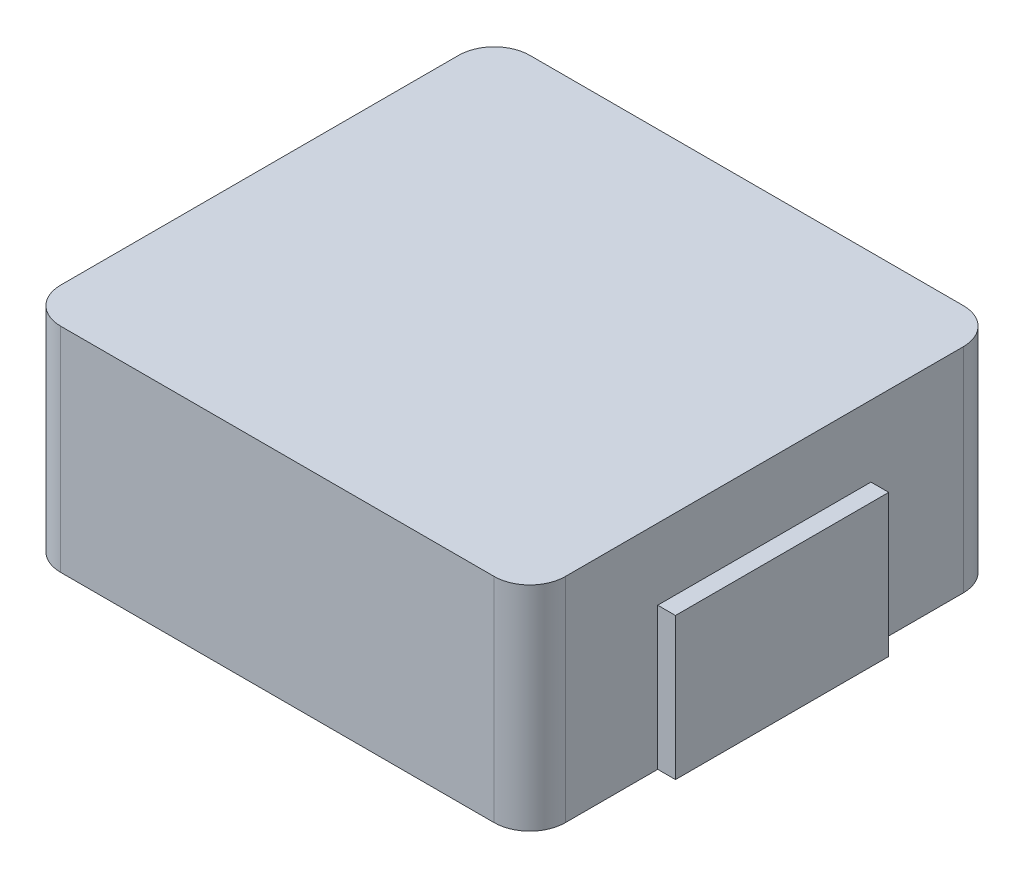
ISO-10303-21;
HEADER;
FILE_DESCRIPTION(('STEP AP214'),'2;1');
FILE_NAME('part.step','',(''),(''),'','','');
FILE_SCHEMA(('AUTOMOTIVE_DESIGN { 1 0 10303 214 1 1 1 1 }'));
ENDSEC;
DATA;
#1=APPLICATION_CONTEXT('core data for automotive mechanical design processes');
#2=APPLICATION_PROTOCOL_DEFINITION('international standard','automotive_design',2000,#1);
#3=PRODUCT_CONTEXT('',#1,'mechanical');
#4=PRODUCT('Part','Part','',(#3));
#5=PRODUCT_RELATED_PRODUCT_CATEGORY('part','',(#4));
#6=PRODUCT_DEFINITION_FORMATION('','',#4);
#7=PRODUCT_DEFINITION_CONTEXT('part definition',#1,'design');
#8=PRODUCT_DEFINITION('design','',#6,#7);
#9=PRODUCT_DEFINITION_SHAPE('','',#8);
#10=(LENGTH_UNIT() NAMED_UNIT(*) SI_UNIT(.MILLI.,.METRE.));
#11=(NAMED_UNIT(*) PLANE_ANGLE_UNIT() SI_UNIT($,.RADIAN.));
#12=(NAMED_UNIT(*) SI_UNIT($,.STERADIAN.) SOLID_ANGLE_UNIT());
#13=UNCERTAINTY_MEASURE_WITH_UNIT(LENGTH_MEASURE(1.E-05),#10,'distance_accuracy_value','');
#14=(GEOMETRIC_REPRESENTATION_CONTEXT(3) GLOBAL_UNCERTAINTY_ASSIGNED_CONTEXT((#13)) GLOBAL_UNIT_ASSIGNED_CONTEXT((#10,
#11,#12)) REPRESENTATION_CONTEXT('',''));
#15=CARTESIAN_POINT('',(0.,0.,0.));
#16=DIRECTION('',(0.,0.,1.));
#17=DIRECTION('',(1.,0.,0.));
#18=AXIS2_PLACEMENT_3D('',#15,#16,#17);
#19=CARTESIAN_POINT('',(3.55,3.,3.3));
#20=DIRECTION('',(-1.,0.,0.));
#21=DIRECTION('',(0.,0.,1.));
#22=AXIS2_PLACEMENT_3D('',#19,#20,#21);
#23=PLANE('',#22);
#24=DIRECTION('',(0.,0.,1.));
#25=VECTOR('',#24,1.);
#26=CARTESIAN_POINT('',(3.55,2.,3.3));
#27=LINE('',#26,#25);
#28=CARTESIAN_POINT('',(3.55,2.,-1.5));
#29=VERTEX_POINT('',#28);
#30=CARTESIAN_POINT('',(3.55,2.,1.5));
#31=VERTEX_POINT('',#30);
#32=EDGE_CURVE('E48',#29,#31,#27,.T.);
#33=ORIENTED_EDGE('',*,*,#32,.F.);
#34=DIRECTION('',(0.,-1.,0.));
#35=VECTOR('',#34,1.);
#36=CARTESIAN_POINT('',(3.55,3.,-1.5));
#37=LINE('',#36,#35);
#38=CARTESIAN_POINT('',(3.55,0.,-1.5));
#39=VERTEX_POINT('',#38);
#40=EDGE_CURVE('E226',#29,#39,#37,.T.);
#41=ORIENTED_EDGE('',*,*,#40,.T.);
#42=DIRECTION('',(0.,0.,-1.));
#43=VECTOR('',#42,1.);
#44=CARTESIAN_POINT('',(3.55,0.,3.3));
#45=LINE('',#44,#43);
#46=CARTESIAN_POINT('',(3.55,0.,-2.8));
#47=VERTEX_POINT('',#46);
#48=EDGE_CURVE('E230',#39,#47,#45,.T.);
#49=ORIENTED_EDGE('',*,*,#48,.T.);
#50=DIRECTION('',(0.,-1.,0.));
#51=VECTOR('',#50,1.);
#52=CARTESIAN_POINT('',(3.55,3.,-2.8));
#53=LINE('',#52,#51);
#54=CARTESIAN_POINT('',(3.55,3.,-2.8));
#55=VERTEX_POINT('',#54);
#56=EDGE_CURVE('E306',#47,#55,#53,.F.);
#57=ORIENTED_EDGE('',*,*,#56,.T.);
#58=DIRECTION('',(0.,0.,-1.));
#59=VECTOR('',#58,1.);
#60=CARTESIAN_POINT('',(3.55,3.,3.3));
#61=LINE('',#60,#59);
#62=CARTESIAN_POINT('',(3.55,3.,2.8));
#63=VERTEX_POINT('',#62);
#64=EDGE_CURVE('E231',#63,#55,#61,.T.);
#65=ORIENTED_EDGE('',*,*,#64,.F.);
#66=DIRECTION('',(0.,-1.,0.));
#67=VECTOR('',#66,1.);
#68=CARTESIAN_POINT('',(3.55,3.,2.8));
#69=LINE('',#68,#67);
#70=CARTESIAN_POINT('',(3.55,0.,2.8));
#71=VERTEX_POINT('',#70);
#72=EDGE_CURVE('E302',#63,#71,#69,.T.);
#73=ORIENTED_EDGE('',*,*,#72,.T.);
#74=CARTESIAN_POINT('',(3.55,0.,1.5));
#75=VERTEX_POINT('',#74);
#76=EDGE_CURVE('E249',#71,#75,#45,.T.);
#77=ORIENTED_EDGE('',*,*,#76,.T.);
#78=DIRECTION('',(0.,1.,0.));
#79=VECTOR('',#78,1.);
#80=CARTESIAN_POINT('',(3.55,3.,1.5));
#81=LINE('',#80,#79);
#82=EDGE_CURVE('E221',#75,#31,#81,.T.);
#83=ORIENTED_EDGE('',*,*,#82,.T.);
#84=EDGE_LOOP('',(#33,#41,#49,#57,#65,#73,#77,#83));
#85=FACE_BOUND('',#84,.T.);
#86=ADVANCED_FACE('F39',(#85),#23,.F.);
#87=CARTESIAN_POINT('',(-3.55,3.,-3.3));
#88=DIRECTION('',(0.,0.,1.));
#89=DIRECTION('',(1.,0.,0.));
#90=AXIS2_PLACEMENT_3D('',#87,#88,#89);
#91=PLANE('',#90);
#92=DIRECTION('',(-1.,0.,0.));
#93=VECTOR('',#92,1.);
#94=CARTESIAN_POINT('',(-3.55,0.,-3.3));
#95=LINE('',#94,#93);
#96=CARTESIAN_POINT('',(3.05,0.,-3.3));
#97=VERTEX_POINT('',#96);
#98=CARTESIAN_POINT('',(-3.05,0.,-3.3));
#99=VERTEX_POINT('',#98);
#100=EDGE_CURVE('E252',#97,#99,#95,.T.);
#101=ORIENTED_EDGE('',*,*,#100,.T.);
#102=DIRECTION('',(0.,-1.,0.));
#103=VECTOR('',#102,1.);
#104=CARTESIAN_POINT('',(-3.05,3.,-3.3));
#105=LINE('',#104,#103);
#106=CARTESIAN_POINT('',(-3.05,3.,-3.3));
#107=VERTEX_POINT('',#106);
#108=EDGE_CURVE('E287',#99,#107,#105,.F.);
#109=ORIENTED_EDGE('',*,*,#108,.T.);
#110=DIRECTION('',(-1.,0.,0.));
#111=VECTOR('',#110,1.);
#112=CARTESIAN_POINT('',(-3.55,3.,-3.3));
#113=LINE('',#112,#111);
#114=CARTESIAN_POINT('',(3.05,3.,-3.3));
#115=VERTEX_POINT('',#114);
#116=EDGE_CURVE('E235',#115,#107,#113,.T.);
#117=ORIENTED_EDGE('',*,*,#116,.F.);
#118=DIRECTION('',(0.,-1.,0.));
#119=VECTOR('',#118,1.);
#120=CARTESIAN_POINT('',(3.05,3.,-3.3));
#121=LINE('',#120,#119);
#122=EDGE_CURVE('E283',#115,#97,#121,.T.);
#123=ORIENTED_EDGE('',*,*,#122,.T.);
#124=EDGE_LOOP('',(#101,#109,#117,#123));
#125=FACE_BOUND('',#124,.T.);
#126=ADVANCED_FACE('F350',(#125),#91,.F.);
#127=CARTESIAN_POINT('',(-3.55,3.,3.3));
#128=DIRECTION('',(1.,0.,0.));
#129=DIRECTION('',(0.,0.,-1.));
#130=AXIS2_PLACEMENT_3D('',#127,#128,#129);
#131=PLANE('',#130);
#132=DIRECTION('',(0.,0.,-1.));
#133=VECTOR('',#132,1.);
#134=CARTESIAN_POINT('',(-3.55,2.,3.3));
#135=LINE('',#134,#133);
#136=CARTESIAN_POINT('',(-3.55,2.,1.5));
#137=VERTEX_POINT('',#136);
#138=CARTESIAN_POINT('',(-3.55,2.,-1.5));
#139=VERTEX_POINT('',#138);
#140=EDGE_CURVE('E11',#137,#139,#135,.T.);
#141=ORIENTED_EDGE('',*,*,#140,.F.);
#142=DIRECTION('',(0.,-1.,0.));
#143=VECTOR('',#142,1.);
#144=CARTESIAN_POINT('',(-3.55,3.,1.5));
#145=LINE('',#144,#143);
#146=CARTESIAN_POINT('',(-3.55,0.,1.5));
#147=VERTEX_POINT('',#146);
#148=EDGE_CURVE('E156',#137,#147,#145,.T.);
#149=ORIENTED_EDGE('',*,*,#148,.T.);
#150=DIRECTION('',(0.,0.,1.));
#151=VECTOR('',#150,1.);
#152=CARTESIAN_POINT('',(-3.55,0.,3.3));
#153=LINE('',#152,#151);
#154=CARTESIAN_POINT('',(-3.55,0.,2.8));
#155=VERTEX_POINT('',#154);
#156=EDGE_CURVE('E256',#147,#155,#153,.T.);
#157=ORIENTED_EDGE('',*,*,#156,.T.);
#158=DIRECTION('',(0.,-1.,0.));
#159=VECTOR('',#158,1.);
#160=CARTESIAN_POINT('',(-3.55,3.,2.8));
#161=LINE('',#160,#159);
#162=CARTESIAN_POINT('',(-3.55,3.,2.8));
#163=VERTEX_POINT('',#162);
#164=EDGE_CURVE('E248',#155,#163,#161,.F.);
#165=ORIENTED_EDGE('',*,*,#164,.T.);
#166=DIRECTION('',(0.,0.,1.));
#167=VECTOR('',#166,1.);
#168=CARTESIAN_POINT('',(-3.55,3.,3.3));
#169=LINE('',#168,#167);
#170=CARTESIAN_POINT('',(-3.55,3.,-2.8));
#171=VERTEX_POINT('',#170);
#172=EDGE_CURVE('E240',#171,#163,#169,.T.);
#173=ORIENTED_EDGE('',*,*,#172,.F.);
#174=DIRECTION('',(0.,-1.,0.));
#175=VECTOR('',#174,1.);
#176=CARTESIAN_POINT('',(-3.55,3.,-2.8));
#177=LINE('',#176,#175);
#178=CARTESIAN_POINT('',(-3.55,0.,-2.8));
#179=VERTEX_POINT('',#178);
#180=EDGE_CURVE('E265',#171,#179,#177,.T.);
#181=ORIENTED_EDGE('',*,*,#180,.T.);
#182=CARTESIAN_POINT('',(-3.55,0.,-1.5));
#183=VERTEX_POINT('',#182);
#184=EDGE_CURVE('E257',#179,#183,#153,.T.);
#185=ORIENTED_EDGE('',*,*,#184,.T.);
#186=DIRECTION('',(0.,1.,0.));
#187=VECTOR('',#186,1.);
#188=CARTESIAN_POINT('',(-3.55,3.,-1.5));
#189=LINE('',#188,#187);
#190=EDGE_CURVE('E55',#183,#139,#189,.T.);
#191=ORIENTED_EDGE('',*,*,#190,.T.);
#192=EDGE_LOOP('',(#141,#149,#157,#165,#173,#181,#185,#191));
#193=FACE_BOUND('',#192,.T.);
#194=ADVANCED_FACE('F357',(#193),#131,.F.);
#195=CARTESIAN_POINT('',(-3.55,3.,3.3));
#196=DIRECTION('',(0.,0.,-1.));
#197=DIRECTION('',(-1.,0.,0.));
#198=AXIS2_PLACEMENT_3D('',#195,#196,#197);
#199=PLANE('',#198);
#200=DIRECTION('',(1.,0.,0.));
#201=VECTOR('',#200,1.);
#202=CARTESIAN_POINT('',(-3.55,0.,3.3));
#203=LINE('',#202,#201);
#204=CARTESIAN_POINT('',(-3.05,0.,3.3));
#205=VERTEX_POINT('',#204);
#206=CARTESIAN_POINT('',(3.05,0.,3.3));
#207=VERTEX_POINT('',#206);
#208=EDGE_CURVE('E236',#205,#207,#203,.T.);
#209=ORIENTED_EDGE('',*,*,#208,.T.);
#210=DIRECTION('',(0.,-1.,0.));
#211=VECTOR('',#210,1.);
#212=CARTESIAN_POINT('',(3.05,3.,3.3));
#213=LINE('',#212,#211);
#214=CARTESIAN_POINT('',(3.05,3.,3.3));
#215=VERTEX_POINT('',#214);
#216=EDGE_CURVE('E313',#207,#215,#213,.F.);
#217=ORIENTED_EDGE('',*,*,#216,.T.);
#218=DIRECTION('',(1.,0.,0.));
#219=VECTOR('',#218,1.);
#220=CARTESIAN_POINT('',(-3.55,3.,3.3));
#221=LINE('',#220,#219);
#222=CARTESIAN_POINT('',(-3.05,3.,3.3));
#223=VERTEX_POINT('',#222);
#224=EDGE_CURVE('E244',#223,#215,#221,.T.);
#225=ORIENTED_EDGE('',*,*,#224,.F.);
#226=DIRECTION('',(0.,-1.,0.));
#227=VECTOR('',#226,1.);
#228=CARTESIAN_POINT('',(-3.05,3.,3.3));
#229=LINE('',#228,#227);
#230=EDGE_CURVE('E309',#223,#205,#229,.T.);
#231=ORIENTED_EDGE('',*,*,#230,.T.);
#232=EDGE_LOOP('',(#209,#217,#225,#231));
#233=FACE_BOUND('',#232,.T.);
#234=ADVANCED_FACE('F365',(#233),#199,.F.);
#235=CARTESIAN_POINT('',(0.,3.,0.));
#236=DIRECTION('',(0.,-1.,0.));
#237=DIRECTION('',(0.,0.,-1.));
#238=AXIS2_PLACEMENT_3D('',#235,#236,#237);
#239=PLANE('',#238);
#240=ORIENTED_EDGE('',*,*,#116,.T.);
#241=CARTESIAN_POINT('',(-3.05,3.,-2.8));
#242=DIRECTION('',(0.,-1.,0.));
#243=DIRECTION('',(0.,0.,-1.));
#244=AXIS2_PLACEMENT_3D('',#241,#242,#243);
#245=CIRCLE('',#244,0.5);
#246=EDGE_CURVE('E299',#107,#171,#245,.F.);
#247=ORIENTED_EDGE('',*,*,#246,.T.);
#248=ORIENTED_EDGE('',*,*,#172,.T.);
#249=CARTESIAN_POINT('',(-3.05,3.,2.8));
#250=DIRECTION('',(0.,-1.,0.));
#251=DIRECTION('',(0.,0.,-1.));
#252=AXIS2_PLACEMENT_3D('',#249,#250,#251);
#253=CIRCLE('',#252,0.5);
#254=EDGE_CURVE('E290',#163,#223,#253,.F.);
#255=ORIENTED_EDGE('',*,*,#254,.T.);
#256=ORIENTED_EDGE('',*,*,#224,.T.);
#257=CARTESIAN_POINT('',(3.05,3.,2.8));
#258=DIRECTION('',(0.,-1.,0.));
#259=DIRECTION('',(0.,0.,-1.));
#260=AXIS2_PLACEMENT_3D('',#257,#258,#259);
#261=CIRCLE('',#260,0.5);
#262=EDGE_CURVE('E293',#215,#63,#261,.F.);
#263=ORIENTED_EDGE('',*,*,#262,.T.);
#264=ORIENTED_EDGE('',*,*,#64,.T.);
#265=CARTESIAN_POINT('',(3.05,3.,-2.8));
#266=DIRECTION('',(0.,-1.,0.));
#267=DIRECTION('',(0.,0.,-1.));
#268=AXIS2_PLACEMENT_3D('',#265,#266,#267);
#269=CIRCLE('',#268,0.5);
#270=EDGE_CURVE('E296',#55,#115,#269,.F.);
#271=ORIENTED_EDGE('',*,*,#270,.T.);
#272=EDGE_LOOP('',(#240,#247,#248,#255,#256,#263,#264,#271));
#273=FACE_BOUND('',#272,.T.);
#274=ADVANCED_FACE('F347',(#273),#239,.F.);
#275=CARTESIAN_POINT('',(0.,0.,0.));
#276=DIRECTION('',(0.,-1.,0.));
#277=DIRECTION('',(0.,0.,-1.));
#278=AXIS2_PLACEMENT_3D('',#275,#276,#277);
#279=PLANE('',#278);
#280=ORIENTED_EDGE('',*,*,#156,.F.);
#281=DIRECTION('',(-1.,0.,0.));
#282=VECTOR('',#281,1.);
#283=CARTESIAN_POINT('',(-3.3,0.,1.5));
#284=LINE('',#283,#282);
#285=CARTESIAN_POINT('',(-3.8,0.,1.5));
#286=VERTEX_POINT('',#285);
#287=EDGE_CURVE('E180',#147,#286,#284,.T.);
#288=ORIENTED_EDGE('',*,*,#287,.T.);
#289=DIRECTION('',(0.,0.,-1.));
#290=VECTOR('',#289,1.);
#291=CARTESIAN_POINT('',(-3.8,0.,1.5));
#292=LINE('',#291,#290);
#293=CARTESIAN_POINT('',(-3.8,0.,-1.5));
#294=VERTEX_POINT('',#293);
#295=EDGE_CURVE('E167',#286,#294,#292,.T.);
#296=ORIENTED_EDGE('',*,*,#295,.T.);
#297=DIRECTION('',(1.,0.,0.));
#298=VECTOR('',#297,1.);
#299=CARTESIAN_POINT('',(-3.3,0.,-1.5));
#300=LINE('',#299,#298);
#301=EDGE_CURVE('E161',#294,#183,#300,.T.);
#302=ORIENTED_EDGE('',*,*,#301,.T.);
#303=ORIENTED_EDGE('',*,*,#184,.F.);
#304=CARTESIAN_POINT('',(-3.05,0.,-2.8));
#305=DIRECTION('',(0.,-1.,0.));
#306=DIRECTION('',(0.,0.,-1.));
#307=AXIS2_PLACEMENT_3D('',#304,#305,#306);
#308=CIRCLE('',#307,0.5);
#309=EDGE_CURVE('E280',#179,#99,#308,.T.);
#310=ORIENTED_EDGE('',*,*,#309,.T.);
#311=ORIENTED_EDGE('',*,*,#100,.F.);
#312=CARTESIAN_POINT('',(3.05,0.,-2.8));
#313=DIRECTION('',(0.,-1.,0.));
#314=DIRECTION('',(0.,0.,-1.));
#315=AXIS2_PLACEMENT_3D('',#312,#313,#314);
#316=CIRCLE('',#315,0.5);
#317=EDGE_CURVE('E276',#97,#47,#316,.T.);
#318=ORIENTED_EDGE('',*,*,#317,.T.);
#319=ORIENTED_EDGE('',*,*,#48,.F.);
#320=DIRECTION('',(1.,0.,0.));
#321=VECTOR('',#320,1.);
#322=CARTESIAN_POINT('',(3.3,0.,-1.5));
#323=LINE('',#322,#321);
#324=CARTESIAN_POINT('',(3.8,0.,-1.5));
#325=VERTEX_POINT('',#324);
#326=EDGE_CURVE('E200',#39,#325,#323,.T.);
#327=ORIENTED_EDGE('',*,*,#326,.T.);
#328=DIRECTION('',(0.,0.,1.));
#329=VECTOR('',#328,1.);
#330=CARTESIAN_POINT('',(3.8,0.,1.5));
#331=LINE('',#330,#329);
#332=CARTESIAN_POINT('',(3.8,0.,1.5));
#333=VERTEX_POINT('',#332);
#334=EDGE_CURVE('E194',#325,#333,#331,.T.);
#335=ORIENTED_EDGE('',*,*,#334,.T.);
#336=DIRECTION('',(-1.,0.,0.));
#337=VECTOR('',#336,1.);
#338=CARTESIAN_POINT('',(3.3,0.,1.5));
#339=LINE('',#338,#337);
#340=EDGE_CURVE('E211',#333,#75,#339,.T.);
#341=ORIENTED_EDGE('',*,*,#340,.T.);
#342=ORIENTED_EDGE('',*,*,#76,.F.);
#343=CARTESIAN_POINT('',(3.05,0.,2.8));
#344=DIRECTION('',(0.,-1.,0.));
#345=DIRECTION('',(0.,0.,-1.));
#346=AXIS2_PLACEMENT_3D('',#343,#344,#345);
#347=CIRCLE('',#346,0.5);
#348=EDGE_CURVE('E273',#71,#207,#347,.T.);
#349=ORIENTED_EDGE('',*,*,#348,.T.);
#350=ORIENTED_EDGE('',*,*,#208,.F.);
#351=CARTESIAN_POINT('',(-3.05,0.,2.8));
#352=DIRECTION('',(0.,-1.,0.));
#353=DIRECTION('',(0.,0.,-1.));
#354=AXIS2_PLACEMENT_3D('',#351,#352,#353);
#355=CIRCLE('',#354,0.5);
#356=EDGE_CURVE('E269',#205,#155,#355,.T.);
#357=ORIENTED_EDGE('',*,*,#356,.T.);
#358=EDGE_LOOP('',(#280,#288,#296,#302,#303,#310,#311,#318,#319,#327,#335,#341,#342,#349,#350,#357));
#359=FACE_BOUND('',#358,.T.);
#360=ADVANCED_FACE('F340',(#359),#279,.T.);
#361=CARTESIAN_POINT('',(-3.05,3.,-2.8));
#362=DIRECTION('',(0.,-1.,0.));
#363=DIRECTION('',(0.,0.,-1.));
#364=AXIS2_PLACEMENT_3D('',#361,#362,#363);
#365=CYLINDRICAL_SURFACE('',#364,0.5);
#366=ORIENTED_EDGE('',*,*,#246,.F.);
#367=ORIENTED_EDGE('',*,*,#108,.F.);
#368=ORIENTED_EDGE('',*,*,#309,.F.);
#369=ORIENTED_EDGE('',*,*,#180,.F.);
#370=EDGE_LOOP('',(#366,#367,#368,#369));
#371=FACE_BOUND('',#370,.T.);
#372=ADVANCED_FACE('F353',(#371),#365,.T.);
#373=CARTESIAN_POINT('',(3.05,3.,-2.8));
#374=DIRECTION('',(0.,-1.,0.));
#375=DIRECTION('',(0.,0.,-1.));
#376=AXIS2_PLACEMENT_3D('',#373,#374,#375);
#377=CYLINDRICAL_SURFACE('',#376,0.5);
#378=ORIENTED_EDGE('',*,*,#270,.F.);
#379=ORIENTED_EDGE('',*,*,#56,.F.);
#380=ORIENTED_EDGE('',*,*,#317,.F.);
#381=ORIENTED_EDGE('',*,*,#122,.F.);
#382=EDGE_LOOP('',(#378,#379,#380,#381));
#383=FACE_BOUND('',#382,.T.);
#384=ADVANCED_FACE('F344',(#383),#377,.T.);
#385=CARTESIAN_POINT('',(3.05,3.,2.8));
#386=DIRECTION('',(0.,-1.,0.));
#387=DIRECTION('',(0.,0.,-1.));
#388=AXIS2_PLACEMENT_3D('',#385,#386,#387);
#389=CYLINDRICAL_SURFACE('',#388,0.5);
#390=ORIENTED_EDGE('',*,*,#262,.F.);
#391=ORIENTED_EDGE('',*,*,#216,.F.);
#392=ORIENTED_EDGE('',*,*,#348,.F.);
#393=ORIENTED_EDGE('',*,*,#72,.F.);
#394=EDGE_LOOP('',(#390,#391,#392,#393));
#395=FACE_BOUND('',#394,.T.);
#396=ADVANCED_FACE('F369',(#395),#389,.T.);
#397=CARTESIAN_POINT('',(-3.05,3.,2.8));
#398=DIRECTION('',(0.,-1.,0.));
#399=DIRECTION('',(0.,0.,-1.));
#400=AXIS2_PLACEMENT_3D('',#397,#398,#399);
#401=CYLINDRICAL_SURFACE('',#400,0.5);
#402=ORIENTED_EDGE('',*,*,#254,.F.);
#403=ORIENTED_EDGE('',*,*,#164,.F.);
#404=ORIENTED_EDGE('',*,*,#356,.F.);
#405=ORIENTED_EDGE('',*,*,#230,.F.);
#406=EDGE_LOOP('',(#402,#403,#404,#405));
#407=FACE_BOUND('',#406,.T.);
#408=ADVANCED_FACE('F41',(#407),#401,.T.);
#409=CARTESIAN_POINT('',(0.,2.,0.));
#410=DIRECTION('',(0.,-1.,0.));
#411=DIRECTION('',(0.,0.,-1.));
#412=AXIS2_PLACEMENT_3D('',#409,#410,#411);
#413=PLANE('',#412);
#414=DIRECTION('',(1.,0.,0.));
#415=VECTOR('',#414,1.);
#416=CARTESIAN_POINT('',(3.3,2.,-1.5));
#417=LINE('',#416,#415);
#418=CARTESIAN_POINT('',(3.8,2.,-1.5));
#419=VERTEX_POINT('',#418);
#420=EDGE_CURVE('E204',#29,#419,#417,.T.);
#421=ORIENTED_EDGE('',*,*,#420,.F.);
#422=ORIENTED_EDGE('',*,*,#32,.T.);
#423=DIRECTION('',(-1.,0.,0.));
#424=VECTOR('',#423,1.);
#425=CARTESIAN_POINT('',(3.3,2.,1.5));
#426=LINE('',#425,#424);
#427=CARTESIAN_POINT('',(3.8,2.,1.5));
#428=VERTEX_POINT('',#427);
#429=EDGE_CURVE('E199',#428,#31,#426,.T.);
#430=ORIENTED_EDGE('',*,*,#429,.F.);
#431=DIRECTION('',(0.,0.,1.));
#432=VECTOR('',#431,1.);
#433=CARTESIAN_POINT('',(3.8,2.,1.5));
#434=LINE('',#433,#432);
#435=EDGE_CURVE('E195',#419,#428,#434,.T.);
#436=ORIENTED_EDGE('',*,*,#435,.F.);
#437=EDGE_LOOP('',(#421,#422,#430,#436));
#438=FACE_BOUND('',#437,.T.);
#439=ADVANCED_FACE('F320',(#438),#413,.F.);
#440=CARTESIAN_POINT('',(3.3,2.,-1.5));
#441=DIRECTION('',(0.,0.,-1.));
#442=DIRECTION('',(-1.,0.,0.));
#443=AXIS2_PLACEMENT_3D('',#440,#441,#442);
#444=PLANE('',#443);
#445=ORIENTED_EDGE('',*,*,#40,.F.);
#446=ORIENTED_EDGE('',*,*,#420,.T.);
#447=DIRECTION('',(0.,-1.,0.));
#448=VECTOR('',#447,1.);
#449=CARTESIAN_POINT('',(3.8,2.,-1.5));
#450=LINE('',#449,#448);
#451=EDGE_CURVE('E217',#419,#325,#450,.T.);
#452=ORIENTED_EDGE('',*,*,#451,.T.);
#453=ORIENTED_EDGE('',*,*,#326,.F.);
#454=EDGE_LOOP('',(#445,#446,#452,#453));
#455=FACE_BOUND('',#454,.T.);
#456=ADVANCED_FACE('F334',(#455),#444,.T.);
#457=CARTESIAN_POINT('',(3.3,2.,1.5));
#458=DIRECTION('',(0.,0.,1.));
#459=DIRECTION('',(1.,0.,0.));
#460=AXIS2_PLACEMENT_3D('',#457,#458,#459);
#461=PLANE('',#460);
#462=ORIENTED_EDGE('',*,*,#82,.F.);
#463=ORIENTED_EDGE('',*,*,#340,.F.);
#464=DIRECTION('',(0.,-1.,0.));
#465=VECTOR('',#464,1.);
#466=CARTESIAN_POINT('',(3.8,2.,1.5));
#467=LINE('',#466,#465);
#468=EDGE_CURVE('E207',#428,#333,#467,.T.);
#469=ORIENTED_EDGE('',*,*,#468,.F.);
#470=ORIENTED_EDGE('',*,*,#429,.T.);
#471=EDGE_LOOP('',(#462,#463,#469,#470));
#472=FACE_BOUND('',#471,.T.);
#473=ADVANCED_FACE('F326',(#472),#461,.T.);
#474=CARTESIAN_POINT('',(3.8,2.,1.5));
#475=DIRECTION('',(1.,0.,0.));
#476=DIRECTION('',(0.,0.,-1.));
#477=AXIS2_PLACEMENT_3D('',#474,#475,#476);
#478=PLANE('',#477);
#479=ORIENTED_EDGE('',*,*,#334,.F.);
#480=ORIENTED_EDGE('',*,*,#451,.F.);
#481=ORIENTED_EDGE('',*,*,#435,.T.);
#482=ORIENTED_EDGE('',*,*,#468,.T.);
#483=EDGE_LOOP('',(#479,#480,#481,#482));
#484=FACE_BOUND('',#483,.T.);
#485=ADVANCED_FACE('F330',(#484),#478,.T.);
#486=CARTESIAN_POINT('',(0.,2.,0.));
#487=DIRECTION('',(0.,-1.,0.));
#488=DIRECTION('',(0.,0.,-1.));
#489=AXIS2_PLACEMENT_3D('',#486,#487,#488);
#490=PLANE('',#489);
#491=DIRECTION('',(-1.,0.,0.));
#492=VECTOR('',#491,1.);
#493=CARTESIAN_POINT('',(-3.3,2.,1.5));
#494=LINE('',#493,#492);
#495=CARTESIAN_POINT('',(-3.8,2.,1.5));
#496=VERTEX_POINT('',#495);
#497=EDGE_CURVE('E150',#137,#496,#494,.T.);
#498=ORIENTED_EDGE('',*,*,#497,.F.);
#499=ORIENTED_EDGE('',*,*,#140,.T.);
#500=DIRECTION('',(1.,0.,0.));
#501=VECTOR('',#500,1.);
#502=CARTESIAN_POINT('',(-3.3,2.,-1.5));
#503=LINE('',#502,#501);
#504=CARTESIAN_POINT('',(-3.8,2.,-1.5));
#505=VERTEX_POINT('',#504);
#506=EDGE_CURVE('E170',#505,#139,#503,.T.);
#507=ORIENTED_EDGE('',*,*,#506,.F.);
#508=DIRECTION('',(0.,0.,-1.));
#509=VECTOR('',#508,1.);
#510=CARTESIAN_POINT('',(-3.8,2.,1.5));
#511=LINE('',#510,#509);
#512=EDGE_CURVE('E160',#496,#505,#511,.T.);
#513=ORIENTED_EDGE('',*,*,#512,.F.);
#514=EDGE_LOOP('',(#498,#499,#507,#513));
#515=FACE_BOUND('',#514,.T.);
#516=ADVANCED_FACE('F173',(#515),#490,.F.);
#517=CARTESIAN_POINT('',(-3.3,2.,1.5));
#518=DIRECTION('',(0.,0.,1.));
#519=DIRECTION('',(1.,0.,0.));
#520=AXIS2_PLACEMENT_3D('',#517,#518,#519);
#521=PLANE('',#520);
#522=ORIENTED_EDGE('',*,*,#148,.F.);
#523=ORIENTED_EDGE('',*,*,#497,.T.);
#524=DIRECTION('',(0.,-1.,0.));
#525=VECTOR('',#524,1.);
#526=CARTESIAN_POINT('',(-3.8,2.,1.5));
#527=LINE('',#526,#525);
#528=EDGE_CURVE('E154',#496,#286,#527,.T.);
#529=ORIENTED_EDGE('',*,*,#528,.T.);
#530=ORIENTED_EDGE('',*,*,#287,.F.);
#531=EDGE_LOOP('',(#522,#523,#529,#530));
#532=FACE_BOUND('',#531,.T.);
#533=ADVANCED_FACE('F152',(#532),#521,.T.);
#534=CARTESIAN_POINT('',(-3.3,2.,-1.5));
#535=DIRECTION('',(0.,0.,-1.));
#536=DIRECTION('',(-1.,0.,0.));
#537=AXIS2_PLACEMENT_3D('',#534,#535,#536);
#538=PLANE('',#537);
#539=ORIENTED_EDGE('',*,*,#190,.F.);
#540=ORIENTED_EDGE('',*,*,#301,.F.);
#541=DIRECTION('',(0.,-1.,0.));
#542=VECTOR('',#541,1.);
#543=CARTESIAN_POINT('',(-3.8,2.,-1.5));
#544=LINE('',#543,#542);
#545=EDGE_CURVE('E169',#505,#294,#544,.T.);
#546=ORIENTED_EDGE('',*,*,#545,.F.);
#547=ORIENTED_EDGE('',*,*,#506,.T.);
#548=EDGE_LOOP('',(#539,#540,#546,#547));
#549=FACE_BOUND('',#548,.T.);
#550=ADVANCED_FACE('F375',(#549),#538,.T.);
#551=CARTESIAN_POINT('',(-3.8,2.,1.5));
#552=DIRECTION('',(-1.,0.,0.));
#553=DIRECTION('',(0.,0.,1.));
#554=AXIS2_PLACEMENT_3D('',#551,#552,#553);
#555=PLANE('',#554);
#556=ORIENTED_EDGE('',*,*,#295,.F.);
#557=ORIENTED_EDGE('',*,*,#528,.F.);
#558=ORIENTED_EDGE('',*,*,#512,.T.);
#559=ORIENTED_EDGE('',*,*,#545,.T.);
#560=EDGE_LOOP('',(#556,#557,#558,#559));
#561=FACE_BOUND('',#560,.T.);
#562=ADVANCED_FACE('F165',(#561),#555,.T.);
#563=CLOSED_SHELL('',(#86,#126,#194,#234,#274,#360,#372,#384,#396,#408,#439,#456,#473,#485,#516,
#533,#550,#562));
#564=MANIFOLD_SOLID_BREP('B2',#563);
#565=ADVANCED_BREP_SHAPE_REPRESENTATION('',(#18,#564),#14);
#566=SHAPE_DEFINITION_REPRESENTATION(#9,#565);
ENDSEC;
END-ISO-10303-21;
